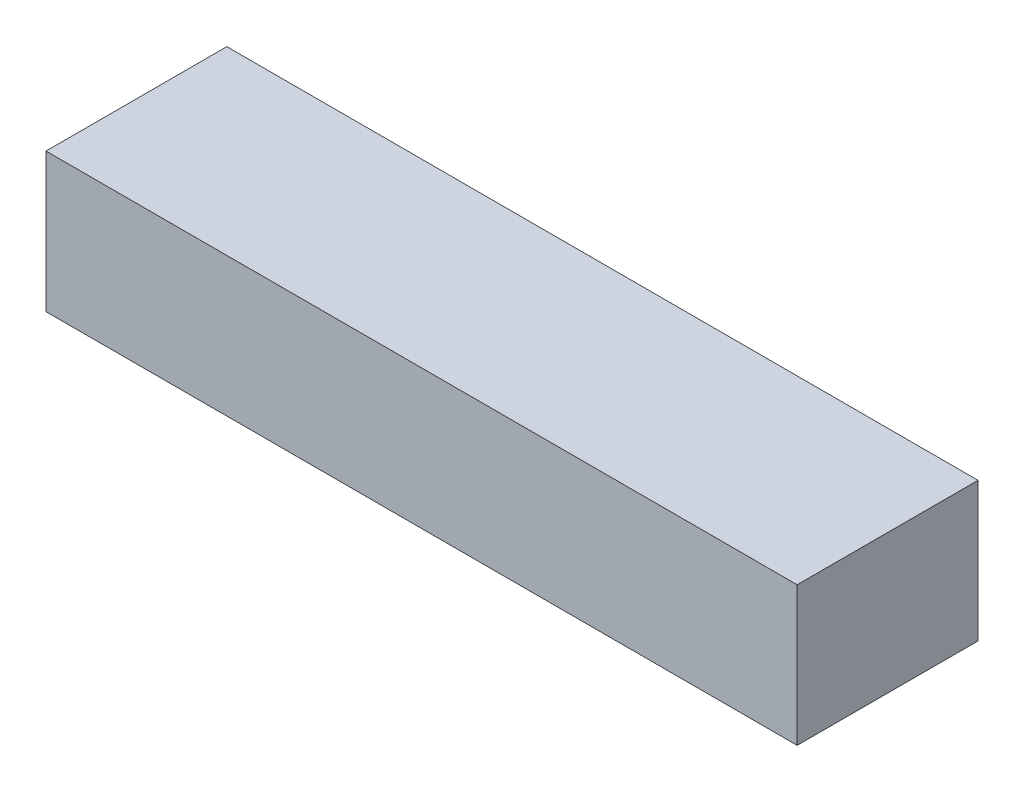
ISO-10303-21;
HEADER;
FILE_DESCRIPTION(('STEP AP214'),'2;1');
FILE_NAME('part.step','',(''),(''),'','','');
FILE_SCHEMA(('AUTOMOTIVE_DESIGN { 1 0 10303 214 1 1 1 1 }'));
ENDSEC;
DATA;
#1=APPLICATION_CONTEXT('core data for automotive mechanical design processes');
#2=APPLICATION_PROTOCOL_DEFINITION('international standard','automotive_design',2000,#1);
#3=PRODUCT_CONTEXT('',#1,'mechanical');
#4=PRODUCT('Part','Part','',(#3));
#5=PRODUCT_RELATED_PRODUCT_CATEGORY('part','',(#4));
#6=PRODUCT_DEFINITION_FORMATION('','',#4);
#7=PRODUCT_DEFINITION_CONTEXT('part definition',#1,'design');
#8=PRODUCT_DEFINITION('design','',#6,#7);
#9=PRODUCT_DEFINITION_SHAPE('','',#8);
#10=(LENGTH_UNIT() NAMED_UNIT(*) SI_UNIT(.MILLI.,.METRE.));
#11=(NAMED_UNIT(*) PLANE_ANGLE_UNIT() SI_UNIT($,.RADIAN.));
#12=(NAMED_UNIT(*) SI_UNIT($,.STERADIAN.) SOLID_ANGLE_UNIT());
#13=UNCERTAINTY_MEASURE_WITH_UNIT(LENGTH_MEASURE(1.E-05),#10,'distance_accuracy_value','');
#14=(GEOMETRIC_REPRESENTATION_CONTEXT(3) GLOBAL_UNCERTAINTY_ASSIGNED_CONTEXT((#13)) GLOBAL_UNIT_ASSIGNED_CONTEXT((#10,
#11,#12)) REPRESENTATION_CONTEXT('',''));
#15=CARTESIAN_POINT('',(0.,0.,0.));
#16=DIRECTION('',(0.,0.,1.));
#17=DIRECTION('',(1.,0.,0.));
#18=AXIS2_PLACEMENT_3D('',#15,#16,#17);
#19=CARTESIAN_POINT('',(-150.010060362173,50.,-20.407444668008));
#20=DIRECTION('',(1.,0.,0.));
#21=DIRECTION('',(0.,0.,-1.));
#22=AXIS2_PLACEMENT_3D('',#19,#20,#21);
#23=PLANE('',#22);
#24=DIRECTION('',(0.,0.,1.));
#25=VECTOR('',#24,1.);
#26=CARTESIAN_POINT('',(-150.010060362173,0.,-20.407444668008));
#27=LINE('',#26,#25);
#28=CARTESIAN_POINT('',(-150.010060362173,0.,-20.407444668008));
#29=VERTEX_POINT('',#28);
#30=CARTESIAN_POINT('',(-150.010060362173,0.,44.592555331992));
#31=VERTEX_POINT('',#30);
#32=EDGE_CURVE('E96',#29,#31,#27,.T.);
#33=ORIENTED_EDGE('',*,*,#32,.T.);
#34=DIRECTION('',(0.,-1.,0.));
#35=VECTOR('',#34,1.);
#36=CARTESIAN_POINT('',(-150.010060362173,50.,44.592555331992));
#37=LINE('',#36,#35);
#38=CARTESIAN_POINT('',(-150.010060362173,50.,44.592555331992));
#39=VERTEX_POINT('',#38);
#40=EDGE_CURVE('E11',#39,#31,#37,.T.);
#41=ORIENTED_EDGE('',*,*,#40,.F.);
#42=DIRECTION('',(0.,0.,1.));
#43=VECTOR('',#42,1.);
#44=CARTESIAN_POINT('',(-150.010060362173,50.,-20.407444668008));
#45=LINE('',#44,#43);
#46=CARTESIAN_POINT('',(-150.010060362173,50.,-20.407444668008));
#47=VERTEX_POINT('',#46);
#48=EDGE_CURVE('E84',#47,#39,#45,.T.);
#49=ORIENTED_EDGE('',*,*,#48,.F.);
#50=DIRECTION('',(0.,-1.,0.));
#51=VECTOR('',#50,1.);
#52=CARTESIAN_POINT('',(-150.010060362173,50.,-20.407444668008));
#53=LINE('',#52,#51);
#54=EDGE_CURVE('E92',#47,#29,#53,.T.);
#55=ORIENTED_EDGE('',*,*,#54,.T.);
#56=EDGE_LOOP('',(#33,#41,#49,#55));
#57=FACE_BOUND('',#56,.T.);
#58=ADVANCED_FACE('F33',(#57),#23,.F.);
#59=CARTESIAN_POINT('',(-150.010060362173,50.,44.592555331992));
#60=DIRECTION('',(0.,0.,-1.));
#61=DIRECTION('',(-1.,0.,0.));
#62=AXIS2_PLACEMENT_3D('',#59,#60,#61);
#63=PLANE('',#62);
#64=DIRECTION('',(1.,0.,0.));
#65=VECTOR('',#64,1.);
#66=CARTESIAN_POINT('',(-150.010060362173,0.,44.592555331992));
#67=LINE('',#66,#65);
#68=CARTESIAN_POINT('',(119.989939637827,0.,44.592555331992));
#69=VERTEX_POINT('',#68);
#70=EDGE_CURVE('E88',#31,#69,#67,.T.);
#71=ORIENTED_EDGE('',*,*,#70,.T.);
#72=DIRECTION('',(0.,-1.,0.));
#73=VECTOR('',#72,1.);
#74=CARTESIAN_POINT('',(119.989939637827,50.,44.592555331992));
#75=LINE('',#74,#73);
#76=CARTESIAN_POINT('',(119.989939637827,50.,44.592555331992));
#77=VERTEX_POINT('',#76);
#78=EDGE_CURVE('E41',#77,#69,#75,.T.);
#79=ORIENTED_EDGE('',*,*,#78,.F.);
#80=DIRECTION('',(1.,0.,0.));
#81=VECTOR('',#80,1.);
#82=CARTESIAN_POINT('',(-150.010060362173,50.,44.592555331992));
#83=LINE('',#82,#81);
#84=EDGE_CURVE('E79',#39,#77,#83,.T.);
#85=ORIENTED_EDGE('',*,*,#84,.F.);
#86=ORIENTED_EDGE('',*,*,#40,.T.);
#87=EDGE_LOOP('',(#71,#79,#85,#86));
#88=FACE_BOUND('',#87,.T.);
#89=ADVANCED_FACE('F87',(#88),#63,.F.);
#90=CARTESIAN_POINT('',(119.989939637827,50.,-20.407444668008));
#91=DIRECTION('',(-1.,0.,0.));
#92=DIRECTION('',(0.,0.,1.));
#93=AXIS2_PLACEMENT_3D('',#90,#91,#92);
#94=PLANE('',#93);
#95=DIRECTION('',(0.,0.,-1.));
#96=VECTOR('',#95,1.);
#97=CARTESIAN_POINT('',(119.989939637827,0.,-20.407444668008));
#98=LINE('',#97,#96);
#99=CARTESIAN_POINT('',(119.989939637827,0.,-20.407444668008));
#100=VERTEX_POINT('',#99);
#101=EDGE_CURVE('E66',#69,#100,#98,.T.);
#102=ORIENTED_EDGE('',*,*,#101,.T.);
#103=DIRECTION('',(0.,-1.,0.));
#104=VECTOR('',#103,1.);
#105=CARTESIAN_POINT('',(119.989939637827,50.,-20.407444668008));
#106=LINE('',#105,#104);
#107=CARTESIAN_POINT('',(119.989939637827,50.,-20.407444668008));
#108=VERTEX_POINT('',#107);
#109=EDGE_CURVE('E89',#108,#100,#106,.T.);
#110=ORIENTED_EDGE('',*,*,#109,.F.);
#111=DIRECTION('',(0.,0.,-1.));
#112=VECTOR('',#111,1.);
#113=CARTESIAN_POINT('',(119.989939637827,50.,-20.407444668008));
#114=LINE('',#113,#112);
#115=EDGE_CURVE('E82',#77,#108,#114,.T.);
#116=ORIENTED_EDGE('',*,*,#115,.F.);
#117=ORIENTED_EDGE('',*,*,#78,.T.);
#118=EDGE_LOOP('',(#102,#110,#116,#117));
#119=FACE_BOUND('',#118,.T.);
#120=ADVANCED_FACE('F90',(#119),#94,.F.);
#121=CARTESIAN_POINT('',(-150.010060362173,50.,-20.407444668008));
#122=DIRECTION('',(0.,0.,1.));
#123=DIRECTION('',(1.,0.,0.));
#124=AXIS2_PLACEMENT_3D('',#121,#122,#123);
#125=PLANE('',#124);
#126=DIRECTION('',(-1.,0.,0.));
#127=VECTOR('',#126,1.);
#128=CARTESIAN_POINT('',(-150.010060362173,0.,-20.407444668008));
#129=LINE('',#128,#127);
#130=EDGE_CURVE('E72',#100,#29,#129,.T.);
#131=ORIENTED_EDGE('',*,*,#130,.T.);
#132=ORIENTED_EDGE('',*,*,#54,.F.);
#133=DIRECTION('',(-1.,0.,0.));
#134=VECTOR('',#133,1.);
#135=CARTESIAN_POINT('',(-150.010060362173,50.,-20.407444668008));
#136=LINE('',#135,#134);
#137=EDGE_CURVE('E49',#108,#47,#136,.T.);
#138=ORIENTED_EDGE('',*,*,#137,.F.);
#139=ORIENTED_EDGE('',*,*,#109,.T.);
#140=EDGE_LOOP('',(#131,#132,#138,#139));
#141=FACE_BOUND('',#140,.T.);
#142=ADVANCED_FACE('F103',(#141),#125,.F.);
#143=CARTESIAN_POINT('',(0.,50.,0.));
#144=DIRECTION('',(0.,1.,0.));
#145=DIRECTION('',(0.,0.,1.));
#146=AXIS2_PLACEMENT_3D('',#143,#144,#145);
#147=PLANE('',#146);
#148=ORIENTED_EDGE('',*,*,#48,.T.);
#149=ORIENTED_EDGE('',*,*,#84,.T.);
#150=ORIENTED_EDGE('',*,*,#115,.T.);
#151=ORIENTED_EDGE('',*,*,#137,.T.);
#152=EDGE_LOOP('',(#148,#149,#150,#151));
#153=FACE_BOUND('',#152,.T.);
#154=ADVANCED_FACE('F80',(#153),#147,.T.);
#155=CARTESIAN_POINT('',(0.,0.,0.));
#156=DIRECTION('',(0.,1.,0.));
#157=DIRECTION('',(0.,0.,1.));
#158=AXIS2_PLACEMENT_3D('',#155,#156,#157);
#159=PLANE('',#158);
#160=ORIENTED_EDGE('',*,*,#32,.F.);
#161=ORIENTED_EDGE('',*,*,#130,.F.);
#162=ORIENTED_EDGE('',*,*,#101,.F.);
#163=ORIENTED_EDGE('',*,*,#70,.F.);
#164=EDGE_LOOP('',(#160,#161,#162,#163));
#165=FACE_BOUND('',#164,.T.);
#166=ADVANCED_FACE('F106',(#165),#159,.F.);
#167=CLOSED_SHELL('',(#58,#89,#120,#142,#154,#166));
#168=MANIFOLD_SOLID_BREP('B2',#167);
#169=ADVANCED_BREP_SHAPE_REPRESENTATION('',(#18,#168),#14);
#170=SHAPE_DEFINITION_REPRESENTATION(#9,#169);
ENDSEC;
END-ISO-10303-21;
